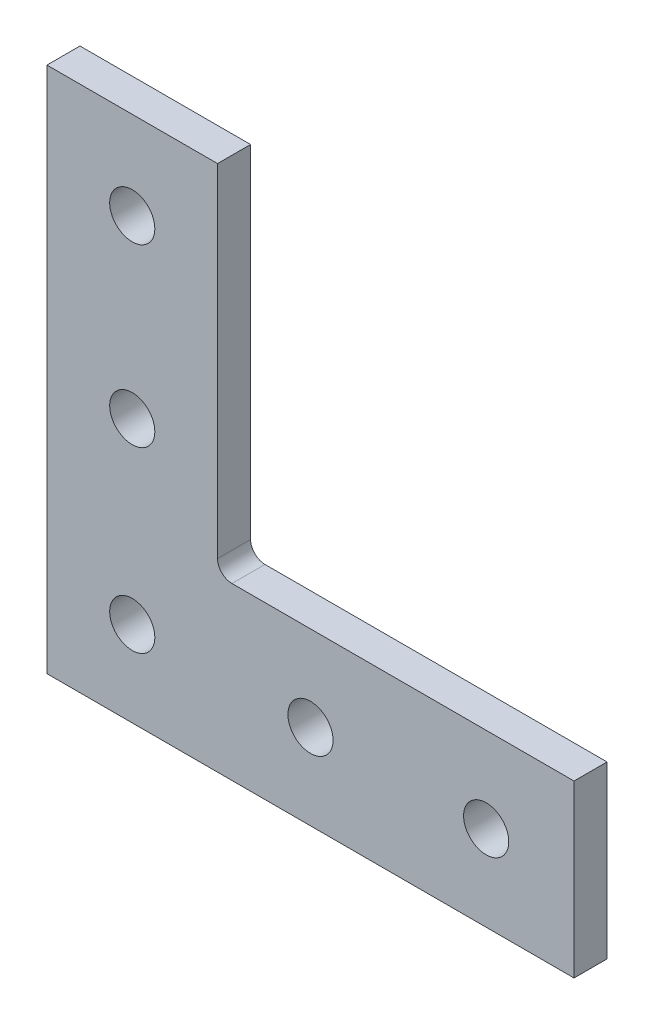
ISO-10303-21;
HEADER;
FILE_DESCRIPTION(('STEP AP214'),'2;1');
FILE_NAME('part.step','',(''),(''),'','','');
FILE_SCHEMA(('AUTOMOTIVE_DESIGN { 1 0 10303 214 1 1 1 1 }'));
ENDSEC;
DATA;
#1=APPLICATION_CONTEXT('core data for automotive mechanical design processes');
#2=APPLICATION_PROTOCOL_DEFINITION('international standard','automotive_design',2000,#1);
#3=PRODUCT_CONTEXT('',#1,'mechanical');
#4=PRODUCT('Part','Part','',(#3));
#5=PRODUCT_RELATED_PRODUCT_CATEGORY('part','',(#4));
#6=PRODUCT_DEFINITION_FORMATION('','',#4);
#7=PRODUCT_DEFINITION_CONTEXT('part definition',#1,'design');
#8=PRODUCT_DEFINITION('design','',#6,#7);
#9=PRODUCT_DEFINITION_SHAPE('','',#8);
#10=(LENGTH_UNIT() NAMED_UNIT(*) SI_UNIT(.MILLI.,.METRE.));
#11=(NAMED_UNIT(*) PLANE_ANGLE_UNIT() SI_UNIT($,.RADIAN.));
#12=(NAMED_UNIT(*) SI_UNIT($,.STERADIAN.) SOLID_ANGLE_UNIT());
#13=UNCERTAINTY_MEASURE_WITH_UNIT(LENGTH_MEASURE(1.E-05),#10,'distance_accuracy_value','');
#14=(GEOMETRIC_REPRESENTATION_CONTEXT(3) GLOBAL_UNCERTAINTY_ASSIGNED_CONTEXT((#13)) GLOBAL_UNIT_ASSIGNED_CONTEXT((#10,
#11,#12)) REPRESENTATION_CONTEXT('',''));
#15=CARTESIAN_POINT('',(0.,0.,0.));
#16=DIRECTION('',(0.,0.,1.));
#17=DIRECTION('',(1.,0.,0.));
#18=AXIS2_PLACEMENT_3D('',#15,#16,#17);
#19=CARTESIAN_POINT('',(-13.4366,-11.3538,-2.3876));
#20=DIRECTION('',(1.,0.,0.));
#21=DIRECTION('',(0.,1.,0.));
#22=AXIS2_PLACEMENT_3D('',#19,#20,#21);
#23=PLANE('',#22);
#24=DIRECTION('',(0.,0.,1.));
#25=VECTOR('',#24,1.);
#26=CARTESIAN_POINT('',(-13.4366,38.1,-2.3876));
#27=LINE('',#26,#25);
#28=CARTESIAN_POINT('',(-13.4366,38.1,-2.3876));
#29=VERTEX_POINT('',#28);
#30=CARTESIAN_POINT('',(-13.4366,38.1,2.3876));
#31=VERTEX_POINT('',#30);
#32=EDGE_CURVE('E95',#29,#31,#27,.T.);
#33=ORIENTED_EDGE('',*,*,#32,.T.);
#34=DIRECTION('',(0.,1.,0.));
#35=VECTOR('',#34,1.);
#36=CARTESIAN_POINT('',(-13.4366,-11.3538,2.3876));
#37=LINE('',#36,#35);
#38=CARTESIAN_POINT('',(-13.4366,-11.3538,2.3876));
#39=VERTEX_POINT('',#38);
#40=EDGE_CURVE('E98',#39,#31,#37,.T.);
#41=ORIENTED_EDGE('',*,*,#40,.F.);
#42=DIRECTION('',(0.,0.,1.));
#43=VECTOR('',#42,1.);
#44=CARTESIAN_POINT('',(-13.4366,-11.3538,-2.3876));
#45=LINE('',#44,#43);
#46=CARTESIAN_POINT('',(-13.4366,-11.3538,-2.3876));
#47=VERTEX_POINT('',#46);
#48=EDGE_CURVE('E11',#47,#39,#45,.T.);
#49=ORIENTED_EDGE('',*,*,#48,.F.);
#50=DIRECTION('',(0.,1.,0.));
#51=VECTOR('',#50,1.);
#52=CARTESIAN_POINT('',(-13.4366,-11.3538,-2.3876));
#53=LINE('',#52,#51);
#54=EDGE_CURVE('E99',#47,#29,#53,.T.);
#55=ORIENTED_EDGE('',*,*,#54,.T.);
#56=EDGE_LOOP('',(#33,#41,#49,#55));
#57=FACE_BOUND('',#56,.T.);
#58=ADVANCED_FACE('F39',(#57),#23,.T.);
#59=CARTESIAN_POINT('',(-11.3538,-11.3538,-2.3876));
#60=DIRECTION('',(0.,0.,1.));
#61=DIRECTION('',(1.,0.,0.));
#62=AXIS2_PLACEMENT_3D('',#59,#60,#61);
#63=CYLINDRICAL_SURFACE('',#62,2.0828);
#64=ORIENTED_EDGE('',*,*,#48,.T.);
#65=CARTESIAN_POINT('',(-11.3538,-11.3538,2.3876));
#66=DIRECTION('',(0.,0.,-1.));
#67=DIRECTION('',(-1.,0.,0.));
#68=AXIS2_PLACEMENT_3D('',#65,#66,#67);
#69=CIRCLE('',#68,2.0828);
#70=CARTESIAN_POINT('',(-11.3538,-13.4366,2.3876));
#71=VERTEX_POINT('',#70);
#72=EDGE_CURVE('E117',#71,#39,#69,.T.);
#73=ORIENTED_EDGE('',*,*,#72,.F.);
#74=DIRECTION('',(0.,0.,1.));
#75=VECTOR('',#74,1.);
#76=CARTESIAN_POINT('',(-11.3538,-13.4366,-2.3876));
#77=LINE('',#76,#75);
#78=CARTESIAN_POINT('',(-11.3538,-13.4366,-2.3876));
#79=VERTEX_POINT('',#78);
#80=EDGE_CURVE('E47',#79,#71,#77,.T.);
#81=ORIENTED_EDGE('',*,*,#80,.F.);
#82=CARTESIAN_POINT('',(-11.3538,-11.3538,-2.3876));
#83=DIRECTION('',(0.,0.,-1.));
#84=DIRECTION('',(-1.,0.,0.));
#85=AXIS2_PLACEMENT_3D('',#82,#83,#84);
#86=CIRCLE('',#85,2.0828);
#87=EDGE_CURVE('E104',#79,#47,#86,.T.);
#88=ORIENTED_EDGE('',*,*,#87,.T.);
#89=EDGE_LOOP('',(#64,#73,#81,#88));
#90=FACE_BOUND('',#89,.T.);
#91=ADVANCED_FACE('F190',(#90),#63,.F.);
#92=CARTESIAN_POINT('',(38.1,-13.4366,-2.3876));
#93=DIRECTION('',(0.,1.,0.));
#94=DIRECTION('',(-1.,0.,0.));
#95=AXIS2_PLACEMENT_3D('',#92,#93,#94);
#96=PLANE('',#95);
#97=ORIENTED_EDGE('',*,*,#80,.T.);
#98=DIRECTION('',(-1.,0.,0.));
#99=VECTOR('',#98,1.);
#100=CARTESIAN_POINT('',(38.1,-13.4366,2.3876));
#101=LINE('',#100,#99);
#102=CARTESIAN_POINT('',(38.1,-13.4366,2.3876));
#103=VERTEX_POINT('',#102);
#104=EDGE_CURVE('E132',#103,#71,#101,.T.);
#105=ORIENTED_EDGE('',*,*,#104,.F.);
#106=DIRECTION('',(0.,0.,1.));
#107=VECTOR('',#106,1.);
#108=CARTESIAN_POINT('',(38.1,-13.4366,-2.3876));
#109=LINE('',#108,#107);
#110=CARTESIAN_POINT('',(38.1,-13.4366,-2.3876));
#111=VERTEX_POINT('',#110);
#112=EDGE_CURVE('E151',#111,#103,#109,.T.);
#113=ORIENTED_EDGE('',*,*,#112,.F.);
#114=DIRECTION('',(-1.,0.,0.));
#115=VECTOR('',#114,1.);
#116=CARTESIAN_POINT('',(38.1,-13.4366,-2.3876));
#117=LINE('',#116,#115);
#118=EDGE_CURVE('E147',#111,#79,#117,.T.);
#119=ORIENTED_EDGE('',*,*,#118,.T.);
#120=EDGE_LOOP('',(#97,#105,#113,#119));
#121=FACE_BOUND('',#120,.T.);
#122=ADVANCED_FACE('F194',(#121),#96,.T.);
#123=CARTESIAN_POINT('',(38.1,-38.1,-2.3876));
#124=DIRECTION('',(1.,0.,0.));
#125=DIRECTION('',(0.,0.,-1.));
#126=AXIS2_PLACEMENT_3D('',#123,#124,#125);
#127=PLANE('',#126);
#128=ORIENTED_EDGE('',*,*,#112,.T.);
#129=DIRECTION('',(0.,1.,0.));
#130=VECTOR('',#129,1.);
#131=CARTESIAN_POINT('',(38.1,-38.1,2.3876));
#132=LINE('',#131,#130);
#133=CARTESIAN_POINT('',(38.1,-38.1,2.3876));
#134=VERTEX_POINT('',#133);
#135=EDGE_CURVE('E129',#134,#103,#132,.T.);
#136=ORIENTED_EDGE('',*,*,#135,.F.);
#137=DIRECTION('',(0.,0.,1.));
#138=VECTOR('',#137,1.);
#139=CARTESIAN_POINT('',(38.1,-38.1,-2.3876));
#140=LINE('',#139,#138);
#141=CARTESIAN_POINT('',(38.1,-38.1,-2.3876));
#142=VERTEX_POINT('',#141);
#143=EDGE_CURVE('E153',#142,#134,#140,.T.);
#144=ORIENTED_EDGE('',*,*,#143,.F.);
#145=DIRECTION('',(0.,1.,0.));
#146=VECTOR('',#145,1.);
#147=CARTESIAN_POINT('',(38.1,-38.1,-2.3876));
#148=LINE('',#147,#146);
#149=EDGE_CURVE('E144',#142,#111,#148,.T.);
#150=ORIENTED_EDGE('',*,*,#149,.T.);
#151=EDGE_LOOP('',(#128,#136,#144,#150));
#152=FACE_BOUND('',#151,.T.);
#153=ADVANCED_FACE('F199',(#152),#127,.T.);
#154=CARTESIAN_POINT('',(-38.1,-38.1,-2.3876));
#155=DIRECTION('',(0.,-1.,0.));
#156=DIRECTION('',(0.,0.,-1.));
#157=AXIS2_PLACEMENT_3D('',#154,#155,#156);
#158=PLANE('',#157);
#159=ORIENTED_EDGE('',*,*,#143,.T.);
#160=DIRECTION('',(1.,0.,0.));
#161=VECTOR('',#160,1.);
#162=CARTESIAN_POINT('',(-38.1,-38.1,2.3876));
#163=LINE('',#162,#161);
#164=CARTESIAN_POINT('',(-38.1,-38.1,2.3876));
#165=VERTEX_POINT('',#164);
#166=EDGE_CURVE('E126',#165,#134,#163,.T.);
#167=ORIENTED_EDGE('',*,*,#166,.F.);
#168=DIRECTION('',(0.,0.,1.));
#169=VECTOR('',#168,1.);
#170=CARTESIAN_POINT('',(-38.1,-38.1,-2.3876));
#171=LINE('',#170,#169);
#172=CARTESIAN_POINT('',(-38.1,-38.1,-2.3876));
#173=VERTEX_POINT('',#172);
#174=EDGE_CURVE('E155',#173,#165,#171,.T.);
#175=ORIENTED_EDGE('',*,*,#174,.F.);
#176=DIRECTION('',(1.,0.,0.));
#177=VECTOR('',#176,1.);
#178=CARTESIAN_POINT('',(-38.1,-38.1,-2.3876));
#179=LINE('',#178,#177);
#180=EDGE_CURVE('E141',#173,#142,#179,.T.);
#181=ORIENTED_EDGE('',*,*,#180,.T.);
#182=EDGE_LOOP('',(#159,#167,#175,#181));
#183=FACE_BOUND('',#182,.T.);
#184=ADVANCED_FACE('F208',(#183),#158,.T.);
#185=CARTESIAN_POINT('',(-38.1,38.1,-2.3876));
#186=DIRECTION('',(-1.,0.,0.));
#187=DIRECTION('',(0.,-1.,0.));
#188=AXIS2_PLACEMENT_3D('',#185,#186,#187);
#189=PLANE('',#188);
#190=ORIENTED_EDGE('',*,*,#174,.T.);
#191=DIRECTION('',(0.,-1.,0.));
#192=VECTOR('',#191,1.);
#193=CARTESIAN_POINT('',(-38.1,38.1,2.3876));
#194=LINE('',#193,#192);
#195=CARTESIAN_POINT('',(-38.1,38.1,2.3876));
#196=VERTEX_POINT('',#195);
#197=EDGE_CURVE('E112',#196,#165,#194,.T.);
#198=ORIENTED_EDGE('',*,*,#197,.F.);
#199=DIRECTION('',(0.,0.,1.));
#200=VECTOR('',#199,1.);
#201=CARTESIAN_POINT('',(-38.1,38.1,-2.3876));
#202=LINE('',#201,#200);
#203=CARTESIAN_POINT('',(-38.1,38.1,-2.3876));
#204=VERTEX_POINT('',#203);
#205=EDGE_CURVE('E103',#204,#196,#202,.T.);
#206=ORIENTED_EDGE('',*,*,#205,.F.);
#207=DIRECTION('',(0.,-1.,0.));
#208=VECTOR('',#207,1.);
#209=CARTESIAN_POINT('',(-38.1,38.1,-2.3876));
#210=LINE('',#209,#208);
#211=EDGE_CURVE('E138',#204,#173,#210,.T.);
#212=ORIENTED_EDGE('',*,*,#211,.T.);
#213=EDGE_LOOP('',(#190,#198,#206,#212));
#214=FACE_BOUND('',#213,.T.);
#215=ADVANCED_FACE('F212',(#214),#189,.T.);
#216=CARTESIAN_POINT('',(-13.4366,38.1,-2.3876));
#217=DIRECTION('',(0.,1.,0.));
#218=DIRECTION('',(0.,0.,1.));
#219=AXIS2_PLACEMENT_3D('',#216,#217,#218);
#220=PLANE('',#219);
#221=ORIENTED_EDGE('',*,*,#205,.T.);
#222=DIRECTION('',(-1.,0.,0.));
#223=VECTOR('',#222,1.);
#224=CARTESIAN_POINT('',(-13.4366,38.1,2.3876));
#225=LINE('',#224,#223);
#226=EDGE_CURVE('E107',#31,#196,#225,.T.);
#227=ORIENTED_EDGE('',*,*,#226,.F.);
#228=ORIENTED_EDGE('',*,*,#32,.F.);
#229=DIRECTION('',(-1.,0.,0.));
#230=VECTOR('',#229,1.);
#231=CARTESIAN_POINT('',(-13.4366,38.1,-2.3876));
#232=LINE('',#231,#230);
#233=EDGE_CURVE('E136',#29,#204,#232,.T.);
#234=ORIENTED_EDGE('',*,*,#233,.T.);
#235=EDGE_LOOP('',(#221,#227,#228,#234));
#236=FACE_BOUND('',#235,.T.);
#237=ADVANCED_FACE('F108',(#236),#220,.T.);
#238=CARTESIAN_POINT('',(-11.3538,-11.3538,-2.3876));
#239=DIRECTION('',(0.,0.,-1.));
#240=DIRECTION('',(-1.,0.,0.));
#241=AXIS2_PLACEMENT_3D('',#238,#239,#240);
#242=PLANE('',#241);
#243=CARTESIAN_POINT('',(-25.7683,25.4,-2.3876));
#244=DIRECTION('',(0.,0.,1.));
#245=DIRECTION('',(1.,0.,0.));
#246=AXIS2_PLACEMENT_3D('',#243,#244,#245);
#247=CIRCLE('',#246,3.2639);
#248=CARTESIAN_POINT('',(-22.5044,25.4,-2.3876));
#249=VERTEX_POINT('',#248);
#250=EDGE_CURVE('E162',#249,#249,#247,.T.);
#251=ORIENTED_EDGE('',*,*,#250,.T.);
#252=EDGE_LOOP('',(#251));
#253=FACE_BOUND('',#252,.T.);
#254=CARTESIAN_POINT('',(-25.7683,-25.7683,-2.3876));
#255=DIRECTION('',(0.,0.,1.));
#256=DIRECTION('',(1.,0.,0.));
#257=AXIS2_PLACEMENT_3D('',#254,#255,#256);
#258=CIRCLE('',#257,3.2639);
#259=CARTESIAN_POINT('',(-22.5044,-25.7683,-2.3876));
#260=VERTEX_POINT('',#259);
#261=EDGE_CURVE('E231',#260,#260,#258,.T.);
#262=ORIENTED_EDGE('',*,*,#261,.T.);
#263=EDGE_LOOP('',(#262));
#264=FACE_BOUND('',#263,.T.);
#265=CARTESIAN_POINT('',(25.4,-25.7683,-2.3876));
#266=DIRECTION('',(0.,0.,1.));
#267=DIRECTION('',(-1.,0.,0.));
#268=AXIS2_PLACEMENT_3D('',#265,#266,#267);
#269=CIRCLE('',#268,3.26390000000001);
#270=CARTESIAN_POINT('',(22.1361,-25.7683,-2.3876));
#271=VERTEX_POINT('',#270);
#272=EDGE_CURVE('E235',#271,#271,#269,.T.);
#273=ORIENTED_EDGE('',*,*,#272,.T.);
#274=EDGE_LOOP('',(#273));
#275=FACE_BOUND('',#274,.T.);
#276=CARTESIAN_POINT('',(0.,-25.7683,-2.3876));
#277=DIRECTION('',(0.,0.,1.));
#278=DIRECTION('',(-1.,0.,0.));
#279=AXIS2_PLACEMENT_3D('',#276,#277,#278);
#280=CIRCLE('',#279,3.26389999999999);
#281=CARTESIAN_POINT('',(-3.26389999999999,-25.7683,-2.3876));
#282=VERTEX_POINT('',#281);
#283=EDGE_CURVE('E122',#282,#282,#280,.T.);
#284=ORIENTED_EDGE('',*,*,#283,.T.);
#285=EDGE_LOOP('',(#284));
#286=FACE_BOUND('',#285,.T.);
#287=CARTESIAN_POINT('',(-25.7683,0.,-2.3876));
#288=DIRECTION('',(0.,0.,1.));
#289=DIRECTION('',(1.,0.,0.));
#290=AXIS2_PLACEMENT_3D('',#287,#288,#289);
#291=CIRCLE('',#290,3.2639);
#292=CARTESIAN_POINT('',(-22.5044,0.,-2.3876));
#293=VERTEX_POINT('',#292);
#294=EDGE_CURVE('E242',#293,#293,#291,.T.);
#295=ORIENTED_EDGE('',*,*,#294,.T.);
#296=EDGE_LOOP('',(#295));
#297=FACE_BOUND('',#296,.T.);
#298=ORIENTED_EDGE('',*,*,#54,.F.);
#299=ORIENTED_EDGE('',*,*,#87,.F.);
#300=ORIENTED_EDGE('',*,*,#118,.F.);
#301=ORIENTED_EDGE('',*,*,#149,.F.);
#302=ORIENTED_EDGE('',*,*,#180,.F.);
#303=ORIENTED_EDGE('',*,*,#211,.F.);
#304=ORIENTED_EDGE('',*,*,#233,.F.);
#305=EDGE_LOOP('',(#298,#299,#300,#301,#302,#303,#304));
#306=FACE_BOUND('',#305,.T.);
#307=ADVANCED_FACE('F203',(#253,#264,#275,#286,#297,#306),#242,.T.);
#308=CARTESIAN_POINT('',(-11.3538,-11.3538,2.3876));
#309=DIRECTION('',(0.,0.,-1.));
#310=DIRECTION('',(-1.,0.,0.));
#311=AXIS2_PLACEMENT_3D('',#308,#309,#310);
#312=PLANE('',#311);
#313=CARTESIAN_POINT('',(-25.7683,25.4,2.3876));
#314=DIRECTION('',(0.,0.,-1.));
#315=DIRECTION('',(-1.,0.,0.));
#316=AXIS2_PLACEMENT_3D('',#313,#314,#315);
#317=CIRCLE('',#316,3.2639);
#318=CARTESIAN_POINT('',(-29.0322,25.4,2.3876));
#319=VERTEX_POINT('',#318);
#320=EDGE_CURVE('E42',#319,#319,#317,.T.);
#321=ORIENTED_EDGE('',*,*,#320,.T.);
#322=EDGE_LOOP('',(#321));
#323=FACE_BOUND('',#322,.T.);
#324=CARTESIAN_POINT('',(-25.7683,-25.7683,2.3876));
#325=DIRECTION('',(0.,0.,-1.));
#326=DIRECTION('',(-1.,0.,0.));
#327=AXIS2_PLACEMENT_3D('',#324,#325,#326);
#328=CIRCLE('',#327,3.2639);
#329=CARTESIAN_POINT('',(-29.0322,-25.7683,2.3876));
#330=VERTEX_POINT('',#329);
#331=EDGE_CURVE('E120',#330,#330,#328,.T.);
#332=ORIENTED_EDGE('',*,*,#331,.T.);
#333=EDGE_LOOP('',(#332));
#334=FACE_BOUND('',#333,.T.);
#335=CARTESIAN_POINT('',(25.4,-25.7683,2.3876));
#336=DIRECTION('',(0.,0.,-1.));
#337=DIRECTION('',(-1.,0.,0.));
#338=AXIS2_PLACEMENT_3D('',#335,#336,#337);
#339=CIRCLE('',#338,3.26390000000001);
#340=CARTESIAN_POINT('',(22.1361,-25.7683,2.3876));
#341=VERTEX_POINT('',#340);
#342=EDGE_CURVE('E165',#341,#341,#339,.T.);
#343=ORIENTED_EDGE('',*,*,#342,.T.);
#344=EDGE_LOOP('',(#343));
#345=FACE_BOUND('',#344,.T.);
#346=CARTESIAN_POINT('',(0.,-25.7683,2.3876));
#347=DIRECTION('',(0.,0.,-1.));
#348=DIRECTION('',(-1.,0.,0.));
#349=AXIS2_PLACEMENT_3D('',#346,#347,#348);
#350=CIRCLE('',#349,3.26389999999999);
#351=CARTESIAN_POINT('',(-3.26389999999999,-25.7683,2.3876));
#352=VERTEX_POINT('',#351);
#353=EDGE_CURVE('E161',#352,#352,#350,.T.);
#354=ORIENTED_EDGE('',*,*,#353,.T.);
#355=EDGE_LOOP('',(#354));
#356=FACE_BOUND('',#355,.T.);
#357=CARTESIAN_POINT('',(-25.7683,0.,2.3876));
#358=DIRECTION('',(0.,0.,-1.));
#359=DIRECTION('',(-1.,0.,0.));
#360=AXIS2_PLACEMENT_3D('',#357,#358,#359);
#361=CIRCLE('',#360,3.2639);
#362=CARTESIAN_POINT('',(-29.0322,0.,2.3876));
#363=VERTEX_POINT('',#362);
#364=EDGE_CURVE('E158',#363,#363,#361,.T.);
#365=ORIENTED_EDGE('',*,*,#364,.T.);
#366=EDGE_LOOP('',(#365));
#367=FACE_BOUND('',#366,.T.);
#368=ORIENTED_EDGE('',*,*,#40,.T.);
#369=ORIENTED_EDGE('',*,*,#226,.T.);
#370=ORIENTED_EDGE('',*,*,#197,.T.);
#371=ORIENTED_EDGE('',*,*,#166,.T.);
#372=ORIENTED_EDGE('',*,*,#135,.T.);
#373=ORIENTED_EDGE('',*,*,#104,.T.);
#374=ORIENTED_EDGE('',*,*,#72,.T.);
#375=EDGE_LOOP('',(#368,#369,#370,#371,#372,#373,#374));
#376=FACE_BOUND('',#375,.T.);
#377=ADVANCED_FACE('F115',(#323,#334,#345,#356,#367,#376),#312,.F.);
#378=CARTESIAN_POINT('',(-25.7683,0.,-2.3876));
#379=DIRECTION('',(0.,0.,1.));
#380=DIRECTION('',(1.,0.,0.));
#381=AXIS2_PLACEMENT_3D('',#378,#379,#380);
#382=CYLINDRICAL_SURFACE('',#381,3.2639);
#383=ORIENTED_EDGE('',*,*,#294,.F.);
#384=EDGE_LOOP('',(#383));
#385=FACE_BOUND('',#384,.T.);
#386=ORIENTED_EDGE('',*,*,#364,.F.);
#387=EDGE_LOOP('',(#386));
#388=FACE_BOUND('',#387,.T.);
#389=ADVANCED_FACE('F224',(#385,#388),#382,.F.);
#390=CARTESIAN_POINT('',(0.,-25.7683,-2.3876));
#391=DIRECTION('',(0.,0.,1.));
#392=DIRECTION('',(1.,0.,0.));
#393=AXIS2_PLACEMENT_3D('',#390,#391,#392);
#394=CYLINDRICAL_SURFACE('',#393,3.26389999999999);
#395=ORIENTED_EDGE('',*,*,#283,.F.);
#396=EDGE_LOOP('',(#395));
#397=FACE_BOUND('',#396,.T.);
#398=ORIENTED_EDGE('',*,*,#353,.F.);
#399=EDGE_LOOP('',(#398));
#400=FACE_BOUND('',#399,.T.);
#401=ADVANCED_FACE('F184',(#397,#400),#394,.F.);
#402=CARTESIAN_POINT('',(25.4,-25.7683,-2.3876));
#403=DIRECTION('',(0.,0.,1.));
#404=DIRECTION('',(1.,0.,0.));
#405=AXIS2_PLACEMENT_3D('',#402,#403,#404);
#406=CYLINDRICAL_SURFACE('',#405,3.26390000000001);
#407=ORIENTED_EDGE('',*,*,#272,.F.);
#408=EDGE_LOOP('',(#407));
#409=FACE_BOUND('',#408,.T.);
#410=ORIENTED_EDGE('',*,*,#342,.F.);
#411=EDGE_LOOP('',(#410));
#412=FACE_BOUND('',#411,.T.);
#413=ADVANCED_FACE('F175',(#409,#412),#406,.F.);
#414=CARTESIAN_POINT('',(-25.7683,-25.7683,-2.3876));
#415=DIRECTION('',(0.,0.,1.));
#416=DIRECTION('',(1.,0.,0.));
#417=AXIS2_PLACEMENT_3D('',#414,#415,#416);
#418=CYLINDRICAL_SURFACE('',#417,3.2639);
#419=ORIENTED_EDGE('',*,*,#261,.F.);
#420=EDGE_LOOP('',(#419));
#421=FACE_BOUND('',#420,.T.);
#422=ORIENTED_EDGE('',*,*,#331,.F.);
#423=EDGE_LOOP('',(#422));
#424=FACE_BOUND('',#423,.T.);
#425=ADVANCED_FACE('F172',(#421,#424),#418,.F.);
#426=CARTESIAN_POINT('',(-25.7683,25.4,-2.3876));
#427=DIRECTION('',(0.,0.,1.));
#428=DIRECTION('',(1.,0.,0.));
#429=AXIS2_PLACEMENT_3D('',#426,#427,#428);
#430=CYLINDRICAL_SURFACE('',#429,3.2639);
#431=ORIENTED_EDGE('',*,*,#250,.F.);
#432=EDGE_LOOP('',(#431));
#433=FACE_BOUND('',#432,.T.);
#434=ORIENTED_EDGE('',*,*,#320,.F.);
#435=EDGE_LOOP('',(#434));
#436=FACE_BOUND('',#435,.T.);
#437=ADVANCED_FACE('F174',(#433,#436),#430,.F.);
#438=CLOSED_SHELL('',(#58,#91,#122,#153,#184,#215,#237,#307,#377,#389,#401,#413,#425,#437));
#439=MANIFOLD_SOLID_BREP('B2',#438);
#440=ADVANCED_BREP_SHAPE_REPRESENTATION('',(#18,#439),#14);
#441=SHAPE_DEFINITION_REPRESENTATION(#9,#440);
ENDSEC;
END-ISO-10303-21;
